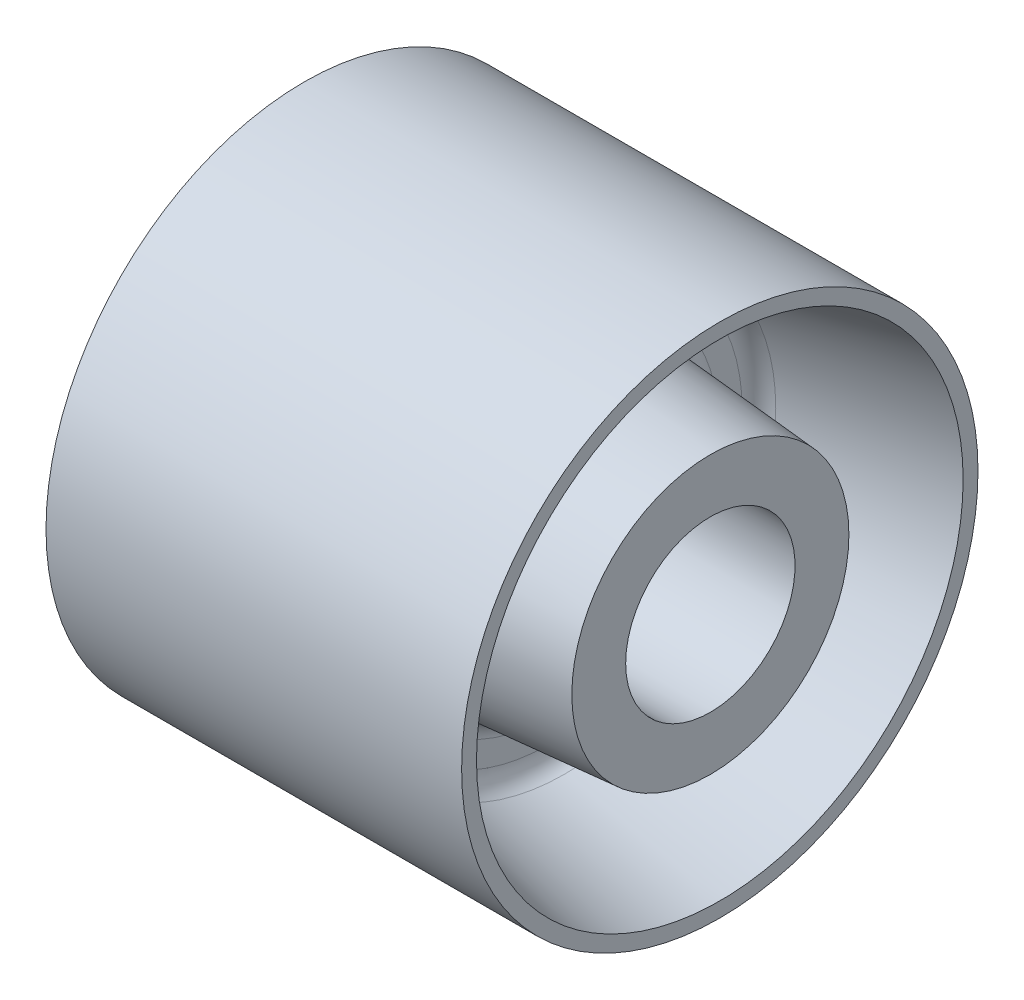
ISO-10303-21;
HEADER;
FILE_DESCRIPTION(('STEP AP214'),'2;1');
FILE_NAME('part.step','',(''),(''),'','','');
FILE_SCHEMA(('AUTOMOTIVE_DESIGN { 1 0 10303 214 1 1 1 1 }'));
ENDSEC;
DATA;
#1=APPLICATION_CONTEXT('core data for automotive mechanical design processes');
#2=APPLICATION_PROTOCOL_DEFINITION('international standard','automotive_design',2000,#1);
#3=PRODUCT_CONTEXT('',#1,'mechanical');
#4=PRODUCT('Part','Part','',(#3));
#5=PRODUCT_RELATED_PRODUCT_CATEGORY('part','',(#4));
#6=PRODUCT_DEFINITION_FORMATION('','',#4);
#7=PRODUCT_DEFINITION_CONTEXT('part definition',#1,'design');
#8=PRODUCT_DEFINITION('design','',#6,#7);
#9=PRODUCT_DEFINITION_SHAPE('','',#8);
#10=(LENGTH_UNIT() NAMED_UNIT(*) SI_UNIT(.MILLI.,.METRE.));
#11=(NAMED_UNIT(*) PLANE_ANGLE_UNIT() SI_UNIT($,.RADIAN.));
#12=(NAMED_UNIT(*) SI_UNIT($,.STERADIAN.) SOLID_ANGLE_UNIT());
#13=UNCERTAINTY_MEASURE_WITH_UNIT(LENGTH_MEASURE(1.E-05),#10,'distance_accuracy_value','');
#14=(GEOMETRIC_REPRESENTATION_CONTEXT(3) GLOBAL_UNCERTAINTY_ASSIGNED_CONTEXT((#13)) GLOBAL_UNIT_ASSIGNED_CONTEXT((#10,
#11,#12)) REPRESENTATION_CONTEXT('',''));
#15=CARTESIAN_POINT('',(0.,0.,0.));
#16=DIRECTION('',(0.,0.,1.));
#17=DIRECTION('',(1.,0.,0.));
#18=AXIS2_PLACEMENT_3D('',#15,#16,#17);
#19=CARTESIAN_POINT('',(-113.627257408462,0.,0.));
#20=DIRECTION('',(-1.,0.,0.));
#21=DIRECTION('',(0.,0.,1.));
#22=AXIS2_PLACEMENT_3D('',#19,#20,#21);
#23=CYLINDRICAL_SURFACE('',#22,13.45);
#24=CARTESIAN_POINT('',(31.5,0.,0.));
#25=DIRECTION('',(-1.,0.,0.));
#26=DIRECTION('',(0.,0.,1.));
#27=AXIS2_PLACEMENT_3D('',#24,#25,#26);
#28=CIRCLE('',#27,13.45);
#29=CARTESIAN_POINT('',(31.5,0.,13.45));
#30=VERTEX_POINT('',#29);
#31=EDGE_CURVE('E63',#30,#30,#28,.T.);
#32=ORIENTED_EDGE('',*,*,#31,.F.);
#33=EDGE_LOOP('',(#32));
#34=FACE_BOUND('',#33,.T.);
#35=CARTESIAN_POINT('',(-31.5,0.,0.));
#36=DIRECTION('',(-1.,0.,0.));
#37=DIRECTION('',(0.,0.,1.));
#38=AXIS2_PLACEMENT_3D('',#35,#36,#37);
#39=CIRCLE('',#38,13.45);
#40=CARTESIAN_POINT('',(-31.5,0.,13.45));
#41=VERTEX_POINT('',#40);
#42=EDGE_CURVE('E87',#41,#41,#39,.T.);
#43=ORIENTED_EDGE('',*,*,#42,.T.);
#44=EDGE_LOOP('',(#43));
#45=FACE_BOUND('',#44,.T.);
#46=ADVANCED_FACE('F34',(#34,#45),#23,.F.);
#47=CARTESIAN_POINT('',(-113.627257408462,0.,0.));
#48=DIRECTION('',(-1.,0.,0.));
#49=DIRECTION('',(0.,0.,1.));
#50=AXIS2_PLACEMENT_3D('',#47,#48,#49);
#51=CYLINDRICAL_SURFACE('',#50,41.);
#52=CARTESIAN_POINT('',(33.,0.,0.));
#53=DIRECTION('',(-1.,0.,0.));
#54=DIRECTION('',(0.,0.,1.));
#55=AXIS2_PLACEMENT_3D('',#52,#53,#54);
#56=CIRCLE('',#55,41.);
#57=CARTESIAN_POINT('',(33.,0.,41.));
#58=VERTEX_POINT('',#57);
#59=EDGE_CURVE('E54',#58,#58,#56,.T.);
#60=ORIENTED_EDGE('',*,*,#59,.T.);
#61=EDGE_LOOP('',(#60));
#62=FACE_BOUND('',#61,.T.);
#63=CARTESIAN_POINT('',(-33.,0.,0.));
#64=DIRECTION('',(-1.,0.,0.));
#65=DIRECTION('',(0.,0.,1.));
#66=AXIS2_PLACEMENT_3D('',#63,#64,#65);
#67=CIRCLE('',#66,41.);
#68=CARTESIAN_POINT('',(-33.,0.,41.));
#69=VERTEX_POINT('',#68);
#70=EDGE_CURVE('E78',#69,#69,#67,.T.);
#71=ORIENTED_EDGE('',*,*,#70,.F.);
#72=EDGE_LOOP('',(#71));
#73=FACE_BOUND('',#72,.T.);
#74=ADVANCED_FACE('F109',(#62,#73),#51,.T.);
#75=CARTESIAN_POINT('',(33.,41.,0.));
#76=DIRECTION('',(-1.,0.,0.));
#77=DIRECTION('',(0.,0.,1.));
#78=AXIS2_PLACEMENT_3D('',#75,#76,#77);
#79=PLANE('',#78);
#80=ORIENTED_EDGE('',*,*,#59,.F.);
#81=EDGE_LOOP('',(#80));
#82=FACE_BOUND('',#81,.T.);
#83=CARTESIAN_POINT('',(33.,0.,0.));
#84=DIRECTION('',(-1.,0.,0.));
#85=DIRECTION('',(0.,0.,1.));
#86=AXIS2_PLACEMENT_3D('',#83,#84,#85);
#87=CIRCLE('',#86,38.6399869989048);
#88=CARTESIAN_POINT('',(33.,0.,38.6399869989048));
#89=VERTEX_POINT('',#88);
#90=EDGE_CURVE('E57',#89,#89,#87,.T.);
#91=ORIENTED_EDGE('',*,*,#90,.T.);
#92=EDGE_LOOP('',(#91));
#93=FACE_BOUND('',#92,.T.);
#94=ADVANCED_FACE('F115',(#82,#93),#79,.F.);
#95=CARTESIAN_POINT('',(6.00000000000001,0.,0.));
#96=DIRECTION('',(1.,0.,0.));
#97=DIRECTION('',(0.,0.,-1.));
#98=AXIS2_PLACEMENT_3D('',#95,#96,#97);
#99=CONICAL_SURFACE('',#98,33.,0.205927314617703);
#100=CARTESIAN_POINT('',(8.38657509056319,0.,0.));
#101=DIRECTION('',(1.,0.,0.));
#102=DIRECTION('',(0.,0.,-1.));
#103=AXIS2_PLACEMENT_3D('',#100,#101,#102);
#104=CIRCLE('',#103,33.4985278697291);
#105=CARTESIAN_POINT('',(8.38657509056319,0.,-33.4985278697291));
#106=VERTEX_POINT('',#105);
#107=EDGE_CURVE('E49',#106,#106,#104,.F.);
#108=ORIENTED_EDGE('',*,*,#107,.T.);
#109=EDGE_LOOP('',(#108));
#110=FACE_BOUND('',#109,.T.);
#111=ORIENTED_EDGE('',*,*,#90,.F.);
#112=EDGE_LOOP('',(#111));
#113=FACE_BOUND('',#112,.T.);
#114=ADVANCED_FACE('F137',(#110,#113),#99,.F.);
#115=CARTESIAN_POINT('',(6.00000000000001,33.,0.));
#116=DIRECTION('',(-1.,0.,0.));
#117=DIRECTION('',(0.,0.,1.));
#118=AXIS2_PLACEMENT_3D('',#115,#116,#117);
#119=PLANE('',#118);
#120=CARTESIAN_POINT('',(6.00000000000001,0.,0.));
#121=DIRECTION('',(-1.,0.,0.));
#122=DIRECTION('',(0.,0.,1.));
#123=AXIS2_PLACEMENT_3D('',#120,#121,#122);
#124=CIRCLE('',#123,26.7739189558656);
#125=CARTESIAN_POINT('',(6.00000000000001,0.,26.7739189558656));
#126=VERTEX_POINT('',#125);
#127=EDGE_CURVE('E41',#126,#126,#124,.T.);
#128=ORIENTED_EDGE('',*,*,#127,.T.);
#129=EDGE_LOOP('',(#128));
#130=FACE_BOUND('',#129,.T.);
#131=CARTESIAN_POINT('',(6.00000000000001,0.,0.));
#132=DIRECTION('',(-1.,0.,0.));
#133=DIRECTION('',(0.,0.,1.));
#134=AXIS2_PLACEMENT_3D('',#131,#132,#133);
#135=CIRCLE('',#134,30.5619124913586);
#136=CARTESIAN_POINT('',(6.00000000000001,0.,30.5619124913586));
#137=VERTEX_POINT('',#136);
#138=EDGE_CURVE('E45',#137,#137,#135,.F.);
#139=ORIENTED_EDGE('',*,*,#138,.T.);
#140=EDGE_LOOP('',(#139));
#141=FACE_BOUND('',#140,.T.);
#142=ADVANCED_FACE('F140',(#130,#141),#119,.F.);
#143=CARTESIAN_POINT('',(31.5,0.,0.));
#144=DIRECTION('',(-1.,0.,0.));
#145=DIRECTION('',(0.,0.,1.));
#146=AXIS2_PLACEMENT_3D('',#143,#144,#145);
#147=CONICAL_SURFACE('',#146,22.,0.078271140521278);
#148=CARTESIAN_POINT('',(8.76542626404411,0.,0.));
#149=DIRECTION('',(-1.,0.,0.));
#150=DIRECTION('',(0.,0.,1.));
#151=AXIS2_PLACEMENT_3D('',#148,#149,#150);
#152=CIRCLE('',#151,23.7831038224279);
#153=CARTESIAN_POINT('',(8.76542626404411,0.,23.7831038224279));
#154=VERTEX_POINT('',#153);
#155=EDGE_CURVE('E10',#154,#154,#152,.F.);
#156=ORIENTED_EDGE('',*,*,#155,.T.);
#157=EDGE_LOOP('',(#156));
#158=FACE_BOUND('',#157,.T.);
#159=CARTESIAN_POINT('',(31.5,0.,0.));
#160=DIRECTION('',(-1.,0.,0.));
#161=DIRECTION('',(0.,0.,1.));
#162=AXIS2_PLACEMENT_3D('',#159,#160,#161);
#163=CIRCLE('',#162,22.);
#164=CARTESIAN_POINT('',(31.5,0.,22.));
#165=VERTEX_POINT('',#164);
#166=EDGE_CURVE('E60',#165,#165,#163,.T.);
#167=ORIENTED_EDGE('',*,*,#166,.T.);
#168=EDGE_LOOP('',(#167));
#169=FACE_BOUND('',#168,.T.);
#170=ADVANCED_FACE('F130',(#158,#169),#147,.T.);
#171=CARTESIAN_POINT('',(31.5,22.,0.));
#172=DIRECTION('',(-1.,0.,0.));
#173=DIRECTION('',(0.,0.,1.));
#174=AXIS2_PLACEMENT_3D('',#171,#172,#173);
#175=PLANE('',#174);
#176=ORIENTED_EDGE('',*,*,#166,.F.);
#177=EDGE_LOOP('',(#176));
#178=FACE_BOUND('',#177,.T.);
#179=ORIENTED_EDGE('',*,*,#31,.T.);
#180=EDGE_LOOP('',(#179));
#181=FACE_BOUND('',#180,.T.);
#182=ADVANCED_FACE('F122',(#178,#181),#175,.F.);
#183=CARTESIAN_POINT('',(9.00000000000001,0.,0.));
#184=DIRECTION('',(-1.,0.,0.));
#185=DIRECTION('',(0.,0.,1.));
#186=AXIS2_PLACEMENT_3D('',#183,#184,#185);
#187=TOROIDAL_SURFACE('',#186,30.5619124913586,3.);
#188=ORIENTED_EDGE('',*,*,#138,.F.);
#189=EDGE_LOOP('',(#188));
#190=FACE_BOUND('',#189,.T.);
#191=ORIENTED_EDGE('',*,*,#107,.F.);
#192=EDGE_LOOP('',(#191));
#193=FACE_BOUND('',#192,.T.);
#194=ADVANCED_FACE('F120',(#190,#193),#187,.F.);
#195=CARTESIAN_POINT('',(9.00000000000001,0.,0.));
#196=DIRECTION('',(-1.,0.,0.));
#197=DIRECTION('',(0.,0.,1.));
#198=AXIS2_PLACEMENT_3D('',#195,#196,#197);
#199=TOROIDAL_SURFACE('',#198,26.7739189558656,3.);
#200=ORIENTED_EDGE('',*,*,#155,.F.);
#201=EDGE_LOOP('',(#200));
#202=FACE_BOUND('',#201,.T.);
#203=ORIENTED_EDGE('',*,*,#127,.F.);
#204=EDGE_LOOP('',(#203));
#205=FACE_BOUND('',#204,.T.);
#206=ADVANCED_FACE('F36',(#202,#205),#199,.F.);
#207=CARTESIAN_POINT('',(-33.,41.,0.));
#208=DIRECTION('',(1.,0.,0.));
#209=DIRECTION('',(0.,0.,1.));
#210=AXIS2_PLACEMENT_3D('',#207,#208,#209);
#211=PLANE('',#210);
#212=ORIENTED_EDGE('',*,*,#70,.T.);
#213=EDGE_LOOP('',(#212));
#214=FACE_BOUND('',#213,.T.);
#215=CARTESIAN_POINT('',(-33.,0.,0.));
#216=DIRECTION('',(-1.,0.,0.));
#217=DIRECTION('',(0.,0.,1.));
#218=AXIS2_PLACEMENT_3D('',#215,#216,#217);
#219=CIRCLE('',#218,38.6399869989048);
#220=CARTESIAN_POINT('',(-33.,0.,38.6399869989048));
#221=VERTEX_POINT('',#220);
#222=EDGE_CURVE('E81',#221,#221,#219,.T.);
#223=ORIENTED_EDGE('',*,*,#222,.F.);
#224=EDGE_LOOP('',(#223));
#225=FACE_BOUND('',#224,.T.);
#226=ADVANCED_FACE('F128',(#214,#225),#211,.F.);
#227=CARTESIAN_POINT('',(-6.00000000000001,0.,0.));
#228=DIRECTION('',(-1.,0.,0.));
#229=DIRECTION('',(0.,0.,-1.));
#230=AXIS2_PLACEMENT_3D('',#227,#228,#229);
#231=CONICAL_SURFACE('',#230,33.,0.205927314617703);
#232=CARTESIAN_POINT('',(-8.38657509056319,0.,0.));
#233=DIRECTION('',(1.,0.,0.));
#234=DIRECTION('',(0.,0.,-1.));
#235=AXIS2_PLACEMENT_3D('',#232,#233,#234);
#236=CIRCLE('',#235,33.4985278697291);
#237=CARTESIAN_POINT('',(-8.38657509056319,0.,-33.4985278697291));
#238=VERTEX_POINT('',#237);
#239=EDGE_CURVE('E75',#238,#238,#236,.F.);
#240=ORIENTED_EDGE('',*,*,#239,.F.);
#241=EDGE_LOOP('',(#240));
#242=FACE_BOUND('',#241,.T.);
#243=ORIENTED_EDGE('',*,*,#222,.T.);
#244=EDGE_LOOP('',(#243));
#245=FACE_BOUND('',#244,.T.);
#246=ADVANCED_FACE('F159',(#242,#245),#231,.F.);
#247=CARTESIAN_POINT('',(-6.00000000000001,33.,0.));
#248=DIRECTION('',(1.,0.,0.));
#249=DIRECTION('',(0.,0.,1.));
#250=AXIS2_PLACEMENT_3D('',#247,#248,#249);
#251=PLANE('',#250);
#252=CARTESIAN_POINT('',(-6.00000000000001,0.,0.));
#253=DIRECTION('',(-1.,0.,0.));
#254=DIRECTION('',(0.,0.,1.));
#255=AXIS2_PLACEMENT_3D('',#252,#253,#254);
#256=CIRCLE('',#255,26.7739189558656);
#257=CARTESIAN_POINT('',(-6.00000000000001,0.,26.7739189558656));
#258=VERTEX_POINT('',#257);
#259=EDGE_CURVE('E69',#258,#258,#256,.T.);
#260=ORIENTED_EDGE('',*,*,#259,.F.);
#261=EDGE_LOOP('',(#260));
#262=FACE_BOUND('',#261,.T.);
#263=CARTESIAN_POINT('',(-6.00000000000001,0.,0.));
#264=DIRECTION('',(-1.,0.,0.));
#265=DIRECTION('',(0.,0.,1.));
#266=AXIS2_PLACEMENT_3D('',#263,#264,#265);
#267=CIRCLE('',#266,30.5619124913586);
#268=CARTESIAN_POINT('',(-6.00000000000001,0.,30.5619124913586));
#269=VERTEX_POINT('',#268);
#270=EDGE_CURVE('E72',#269,#269,#267,.F.);
#271=ORIENTED_EDGE('',*,*,#270,.F.);
#272=EDGE_LOOP('',(#271));
#273=FACE_BOUND('',#272,.T.);
#274=ADVANCED_FACE('F105',(#262,#273),#251,.F.);
#275=CARTESIAN_POINT('',(-31.5,0.,0.));
#276=DIRECTION('',(1.,0.,0.));
#277=DIRECTION('',(0.,0.,1.));
#278=AXIS2_PLACEMENT_3D('',#275,#276,#277);
#279=CONICAL_SURFACE('',#278,22.,0.078271140521278);
#280=CARTESIAN_POINT('',(-8.76542626404411,0.,0.));
#281=DIRECTION('',(-1.,0.,0.));
#282=DIRECTION('',(0.,0.,1.));
#283=AXIS2_PLACEMENT_3D('',#280,#281,#282);
#284=CIRCLE('',#283,23.7831038224279);
#285=CARTESIAN_POINT('',(-8.76542626404411,0.,23.7831038224279));
#286=VERTEX_POINT('',#285);
#287=EDGE_CURVE('E66',#286,#286,#284,.F.);
#288=ORIENTED_EDGE('',*,*,#287,.F.);
#289=EDGE_LOOP('',(#288));
#290=FACE_BOUND('',#289,.T.);
#291=CARTESIAN_POINT('',(-31.5,0.,0.));
#292=DIRECTION('',(-1.,0.,0.));
#293=DIRECTION('',(0.,0.,1.));
#294=AXIS2_PLACEMENT_3D('',#291,#292,#293);
#295=CIRCLE('',#294,22.);
#296=CARTESIAN_POINT('',(-31.5,0.,22.));
#297=VERTEX_POINT('',#296);
#298=EDGE_CURVE('E84',#297,#297,#295,.T.);
#299=ORIENTED_EDGE('',*,*,#298,.F.);
#300=EDGE_LOOP('',(#299));
#301=FACE_BOUND('',#300,.T.);
#302=ADVANCED_FACE('F95',(#290,#301),#279,.T.);
#303=CARTESIAN_POINT('',(-31.5,22.,0.));
#304=DIRECTION('',(1.,0.,0.));
#305=DIRECTION('',(0.,0.,1.));
#306=AXIS2_PLACEMENT_3D('',#303,#304,#305);
#307=PLANE('',#306);
#308=ORIENTED_EDGE('',*,*,#298,.T.);
#309=EDGE_LOOP('',(#308));
#310=FACE_BOUND('',#309,.T.);
#311=ORIENTED_EDGE('',*,*,#42,.F.);
#312=EDGE_LOOP('',(#311));
#313=FACE_BOUND('',#312,.T.);
#314=ADVANCED_FACE('F92',(#310,#313),#307,.F.);
#315=CARTESIAN_POINT('',(-9.00000000000001,0.,0.));
#316=DIRECTION('',(1.,0.,0.));
#317=DIRECTION('',(0.,0.,1.));
#318=AXIS2_PLACEMENT_3D('',#315,#316,#317);
#319=TOROIDAL_SURFACE('',#318,30.5619124913586,3.);
#320=ORIENTED_EDGE('',*,*,#270,.T.);
#321=EDGE_LOOP('',(#320));
#322=FACE_BOUND('',#321,.T.);
#323=ORIENTED_EDGE('',*,*,#239,.T.);
#324=EDGE_LOOP('',(#323));
#325=FACE_BOUND('',#324,.T.);
#326=ADVANCED_FACE('F94',(#322,#325),#319,.F.);
#327=CARTESIAN_POINT('',(-9.00000000000001,0.,0.));
#328=DIRECTION('',(1.,0.,0.));
#329=DIRECTION('',(0.,0.,1.));
#330=AXIS2_PLACEMENT_3D('',#327,#328,#329);
#331=TOROIDAL_SURFACE('',#330,26.7739189558656,3.);
#332=ORIENTED_EDGE('',*,*,#287,.T.);
#333=EDGE_LOOP('',(#332));
#334=FACE_BOUND('',#333,.T.);
#335=ORIENTED_EDGE('',*,*,#259,.T.);
#336=EDGE_LOOP('',(#335));
#337=FACE_BOUND('',#336,.T.);
#338=ADVANCED_FACE('F102',(#334,#337),#331,.F.);
#339=CLOSED_SHELL('',(#46,#74,#94,#114,#142,#170,#182,#194,#206,#226,#246,#274,#302,#314,#326,#338));
#340=MANIFOLD_SOLID_BREP('B2',#339);
#341=ADVANCED_BREP_SHAPE_REPRESENTATION('',(#18,#340),#14);
#342=SHAPE_DEFINITION_REPRESENTATION(#9,#341);
ENDSEC;
END-ISO-10303-21;
